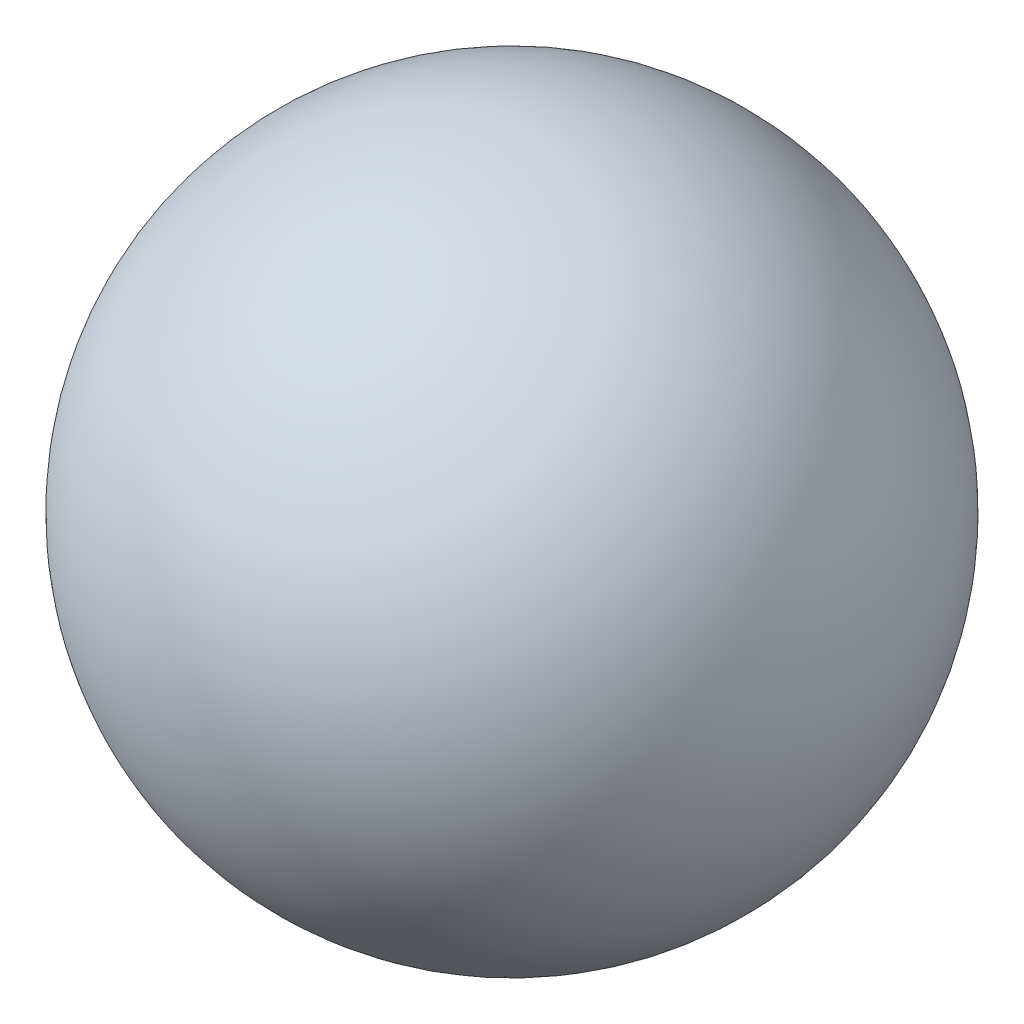
ISO-10303-21;
HEADER;
FILE_DESCRIPTION(('STEP AP214'),'2;1');
FILE_NAME('part.step','',(''),(''),'','','');
FILE_SCHEMA(('AUTOMOTIVE_DESIGN { 1 0 10303 214 1 1 1 1 }'));
ENDSEC;
DATA;
#1=APPLICATION_CONTEXT('core data for automotive mechanical design processes');
#2=APPLICATION_PROTOCOL_DEFINITION('international standard','automotive_design',2000,#1);
#3=PRODUCT_CONTEXT('',#1,'mechanical');
#4=PRODUCT('Part','Part','',(#3));
#5=PRODUCT_RELATED_PRODUCT_CATEGORY('part','',(#4));
#6=PRODUCT_DEFINITION_FORMATION('','',#4);
#7=PRODUCT_DEFINITION_CONTEXT('part definition',#1,'design');
#8=PRODUCT_DEFINITION('design','',#6,#7);
#9=PRODUCT_DEFINITION_SHAPE('','',#8);
#10=(LENGTH_UNIT() NAMED_UNIT(*) SI_UNIT(.MILLI.,.METRE.));
#11=(NAMED_UNIT(*) PLANE_ANGLE_UNIT() SI_UNIT($,.RADIAN.));
#12=(NAMED_UNIT(*) SI_UNIT($,.STERADIAN.) SOLID_ANGLE_UNIT());
#13=UNCERTAINTY_MEASURE_WITH_UNIT(LENGTH_MEASURE(1.E-05),#10,'distance_accuracy_value','');
#14=(GEOMETRIC_REPRESENTATION_CONTEXT(3) GLOBAL_UNCERTAINTY_ASSIGNED_CONTEXT((#13)) GLOBAL_UNIT_ASSIGNED_CONTEXT((#10,
#11,#12)) REPRESENTATION_CONTEXT('',''));
#15=CARTESIAN_POINT('',(0.,0.,0.));
#16=DIRECTION('',(0.,0.,1.));
#17=DIRECTION('',(1.,0.,0.));
#18=AXIS2_PLACEMENT_3D('',#15,#16,#17);
#19=CARTESIAN_POINT('',(0.,0.,0.));
#20=DIRECTION('',(0.,0.,-1.));
#21=DIRECTION('',(1.,0.,0.));
#22=AXIS2_PLACEMENT_3D('',#19,#20,#21);
#23=SPHERICAL_SURFACE('',#22,4.75);
#24=CARTESIAN_POINT('',(0.,0.,-4.75));
#25=VERTEX_POINT('',#24);
#26=VERTEX_LOOP('',#25);
#27=FACE_BOUND('',#26,.T.);
#28=ADVANCED_FACE('F30',(#27),#23,.T.);
#29=CLOSED_SHELL('',(#28));
#30=MANIFOLD_SOLID_BREP('B2',#29);
#31=ADVANCED_BREP_SHAPE_REPRESENTATION('',(#18,#30),#14);
#32=SHAPE_DEFINITION_REPRESENTATION(#9,#31);
ENDSEC;
END-ISO-10303-21;
